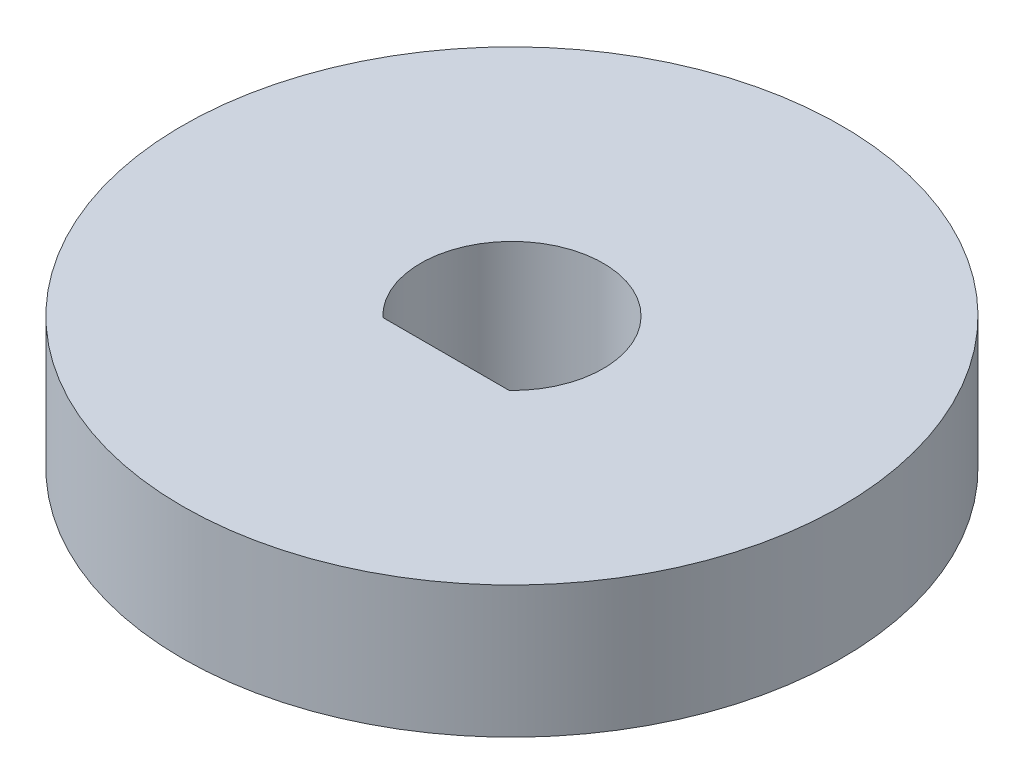
ISO-10303-21;
HEADER;
FILE_DESCRIPTION(('STEP AP214'),'2;1');
FILE_NAME('part.step','',(''),(''),'','','');
FILE_SCHEMA(('AUTOMOTIVE_DESIGN { 1 0 10303 214 1 1 1 1 }'));
ENDSEC;
DATA;
#1=APPLICATION_CONTEXT('core data for automotive mechanical design processes');
#2=APPLICATION_PROTOCOL_DEFINITION('international standard','automotive_design',2000,#1);
#3=PRODUCT_CONTEXT('',#1,'mechanical');
#4=PRODUCT('Part','Part','',(#3));
#5=PRODUCT_RELATED_PRODUCT_CATEGORY('part','',(#4));
#6=PRODUCT_DEFINITION_FORMATION('','',#4);
#7=PRODUCT_DEFINITION_CONTEXT('part definition',#1,'design');
#8=PRODUCT_DEFINITION('design','',#6,#7);
#9=PRODUCT_DEFINITION_SHAPE('','',#8);
#10=(LENGTH_UNIT() NAMED_UNIT(*) SI_UNIT(.MILLI.,.METRE.));
#11=(NAMED_UNIT(*) PLANE_ANGLE_UNIT() SI_UNIT($,.RADIAN.));
#12=(NAMED_UNIT(*) SI_UNIT($,.STERADIAN.) SOLID_ANGLE_UNIT());
#13=UNCERTAINTY_MEASURE_WITH_UNIT(LENGTH_MEASURE(1.E-05),#10,'distance_accuracy_value','');
#14=(GEOMETRIC_REPRESENTATION_CONTEXT(3) GLOBAL_UNCERTAINTY_ASSIGNED_CONTEXT((#13)) GLOBAL_UNIT_ASSIGNED_CONTEXT((#10,
#11,#12)) REPRESENTATION_CONTEXT('',''));
#15=CARTESIAN_POINT('',(0.,0.,0.));
#16=DIRECTION('',(0.,0.,1.));
#17=DIRECTION('',(1.,0.,0.));
#18=AXIS2_PLACEMENT_3D('',#15,#16,#17);
#19=CARTESIAN_POINT('',(0.,4.,0.));
#20=DIRECTION('',(0.,1.,0.));
#21=DIRECTION('',(0.,0.,1.));
#22=AXIS2_PLACEMENT_3D('',#19,#20,#21);
#23=PLANE('',#22);
#24=CARTESIAN_POINT('',(0.,4.,0.));
#25=DIRECTION('',(0.,1.,0.));
#26=DIRECTION('',(0.,0.,1.));
#27=AXIS2_PLACEMENT_3D('',#24,#25,#26);
#28=CIRCLE('',#27,10.);
#29=CARTESIAN_POINT('',(0.,4.,10.));
#30=VERTEX_POINT('',#29);
#31=EDGE_CURVE('E12',#30,#30,#28,.T.);
#32=ORIENTED_EDGE('',*,*,#31,.T.);
#33=EDGE_LOOP('',(#32));
#34=FACE_BOUND('',#33,.T.);
#35=CARTESIAN_POINT('',(0.,4.,0.));
#36=DIRECTION('',(0.,1.,0.));
#37=DIRECTION('',(0.,0.,1.));
#38=AXIS2_PLACEMENT_3D('',#35,#36,#37);
#39=CIRCLE('',#38,2.7712812921102);
#40=CARTESIAN_POINT('',(1.91833260932509,4.,2.));
#41=VERTEX_POINT('',#40);
#42=CARTESIAN_POINT('',(-1.91833260932509,4.,2.));
#43=VERTEX_POINT('',#42);
#44=EDGE_CURVE('E87',#41,#43,#39,.T.);
#45=ORIENTED_EDGE('',*,*,#44,.F.);
#46=DIRECTION('',(1.,0.,0.));
#47=VECTOR('',#46,1.);
#48=CARTESIAN_POINT('',(0.,4.,2.));
#49=LINE('',#48,#47);
#50=EDGE_CURVE('E78',#43,#41,#49,.T.);
#51=ORIENTED_EDGE('',*,*,#50,.F.);
#52=EDGE_LOOP('',(#45,#51));
#53=FACE_BOUND('',#52,.T.);
#54=ADVANCED_FACE('F46',(#34,#53),#23,.T.);
#55=CARTESIAN_POINT('',(0.,0.,0.));
#56=DIRECTION('',(0.,1.,0.));
#57=DIRECTION('',(0.,0.,1.));
#58=AXIS2_PLACEMENT_3D('',#55,#56,#57);
#59=PLANE('',#58);
#60=CARTESIAN_POINT('',(0.,0.,0.));
#61=DIRECTION('',(0.,1.,0.));
#62=DIRECTION('',(0.,0.,1.));
#63=AXIS2_PLACEMENT_3D('',#60,#61,#62);
#64=CIRCLE('',#63,10.);
#65=CARTESIAN_POINT('',(0.,0.,10.));
#66=VERTEX_POINT('',#65);
#67=EDGE_CURVE('E50',#66,#66,#64,.T.);
#68=ORIENTED_EDGE('',*,*,#67,.F.);
#69=EDGE_LOOP('',(#68));
#70=FACE_BOUND('',#69,.T.);
#71=DIRECTION('',(1.,0.,0.));
#72=VECTOR('',#71,1.);
#73=CARTESIAN_POINT('',(0.,0.,2.));
#74=LINE('',#73,#72);
#75=CARTESIAN_POINT('',(-1.91833260932509,0.,2.));
#76=VERTEX_POINT('',#75);
#77=CARTESIAN_POINT('',(1.91833260932509,0.,2.));
#78=VERTEX_POINT('',#77);
#79=EDGE_CURVE('E68',#76,#78,#74,.T.);
#80=ORIENTED_EDGE('',*,*,#79,.T.);
#81=CARTESIAN_POINT('',(0.,0.,0.));
#82=DIRECTION('',(0.,1.,0.));
#83=DIRECTION('',(0.,0.,1.));
#84=AXIS2_PLACEMENT_3D('',#81,#82,#83);
#85=CIRCLE('',#84,2.7712812921102);
#86=EDGE_CURVE('E74',#78,#76,#85,.T.);
#87=ORIENTED_EDGE('',*,*,#86,.T.);
#88=EDGE_LOOP('',(#80,#87));
#89=FACE_BOUND('',#88,.T.);
#90=ADVANCED_FACE('F84',(#70,#89),#59,.F.);
#91=CARTESIAN_POINT('',(0.,4.,0.));
#92=DIRECTION('',(0.,-1.,0.));
#93=DIRECTION('',(0.,0.,-1.));
#94=AXIS2_PLACEMENT_3D('',#91,#92,#93);
#95=CYLINDRICAL_SURFACE('',#94,10.);
#96=ORIENTED_EDGE('',*,*,#31,.F.);
#97=EDGE_LOOP('',(#96));
#98=FACE_BOUND('',#97,.T.);
#99=ORIENTED_EDGE('',*,*,#67,.T.);
#100=EDGE_LOOP('',(#99));
#101=FACE_BOUND('',#100,.T.);
#102=ADVANCED_FACE('F48',(#98,#101),#95,.T.);
#103=CARTESIAN_POINT('',(0.,4.,2.));
#104=DIRECTION('',(0.,0.,-1.));
#105=DIRECTION('',(-1.,0.,0.));
#106=AXIS2_PLACEMENT_3D('',#103,#104,#105);
#107=PLANE('',#106);
#108=ORIENTED_EDGE('',*,*,#79,.F.);
#109=DIRECTION('',(0.,-1.,0.));
#110=VECTOR('',#109,1.);
#111=CARTESIAN_POINT('',(-1.91833260932509,4.,2.));
#112=LINE('',#111,#110);
#113=EDGE_CURVE('E76',#43,#76,#112,.T.);
#114=ORIENTED_EDGE('',*,*,#113,.F.);
#115=ORIENTED_EDGE('',*,*,#50,.T.);
#116=DIRECTION('',(0.,-1.,0.));
#117=VECTOR('',#116,1.);
#118=CARTESIAN_POINT('',(1.91833260932509,4.,2.));
#119=LINE('',#118,#117);
#120=EDGE_CURVE('E61',#41,#78,#119,.T.);
#121=ORIENTED_EDGE('',*,*,#120,.T.);
#122=EDGE_LOOP('',(#108,#114,#115,#121));
#123=FACE_BOUND('',#122,.T.);
#124=ADVANCED_FACE('F80',(#123),#107,.T.);
#125=CARTESIAN_POINT('',(0.,4.,0.));
#126=DIRECTION('',(0.,-1.,0.));
#127=DIRECTION('',(0.,0.,-1.));
#128=AXIS2_PLACEMENT_3D('',#125,#126,#127);
#129=CYLINDRICAL_SURFACE('',#128,2.7712812921102);
#130=ORIENTED_EDGE('',*,*,#86,.F.);
#131=ORIENTED_EDGE('',*,*,#120,.F.);
#132=ORIENTED_EDGE('',*,*,#44,.T.);
#133=ORIENTED_EDGE('',*,*,#113,.T.);
#134=EDGE_LOOP('',(#130,#131,#132,#133));
#135=FACE_BOUND('',#134,.T.);
#136=ADVANCED_FACE('F75',(#135),#129,.F.);
#137=CLOSED_SHELL('',(#54,#90,#102,#124,#136));
#138=MANIFOLD_SOLID_BREP('B2',#137);
#139=ADVANCED_BREP_SHAPE_REPRESENTATION('',(#18,#138),#14);
#140=SHAPE_DEFINITION_REPRESENTATION(#9,#139);
ENDSEC;
END-ISO-10303-21;
